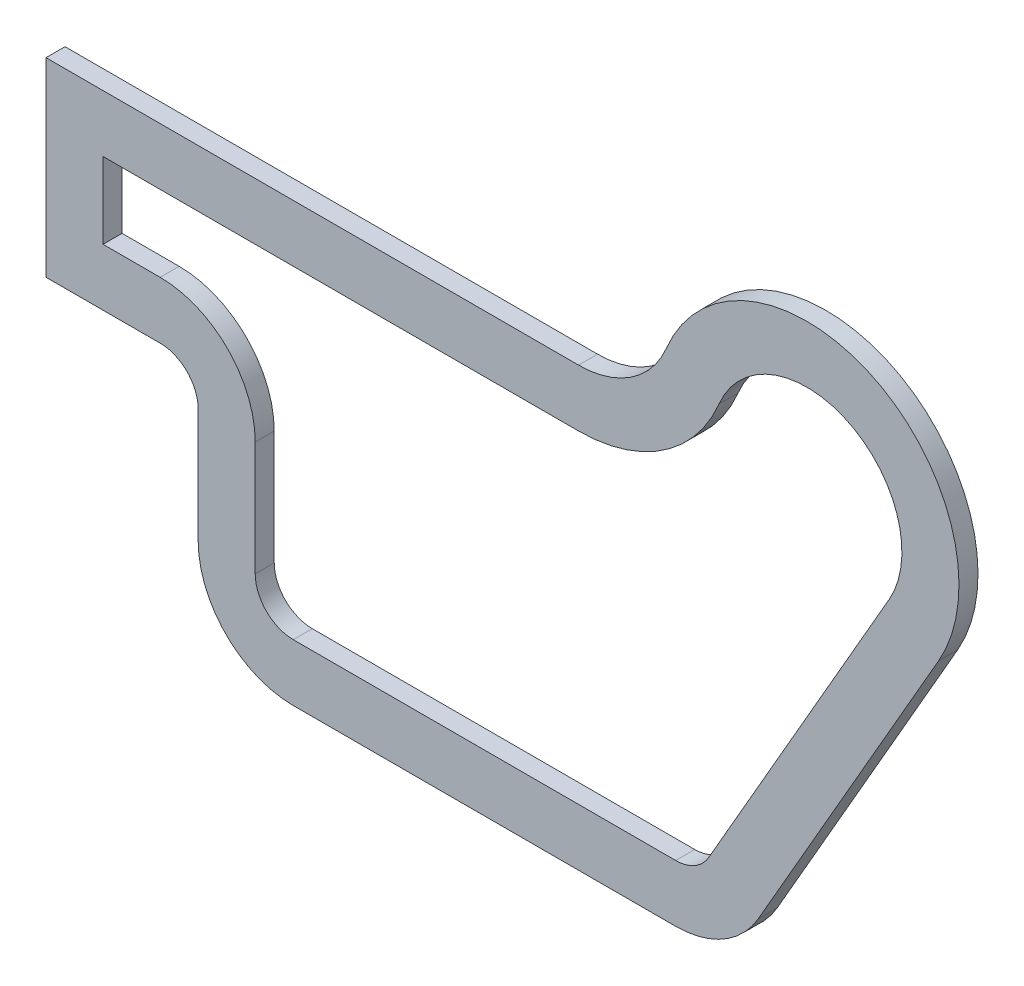
ISO-10303-21;
HEADER;
FILE_DESCRIPTION(('STEP AP214'),'2;1');
FILE_NAME('part.step','',(''),(''),'','','');
FILE_SCHEMA(('AUTOMOTIVE_DESIGN { 1 0 10303 214 1 1 1 1 }'));
ENDSEC;
DATA;
#1=APPLICATION_CONTEXT('core data for automotive mechanical design processes');
#2=APPLICATION_PROTOCOL_DEFINITION('international standard','automotive_design',2000,#1);
#3=PRODUCT_CONTEXT('',#1,'mechanical');
#4=PRODUCT('Part','Part','',(#3));
#5=PRODUCT_RELATED_PRODUCT_CATEGORY('part','',(#4));
#6=PRODUCT_DEFINITION_FORMATION('','',#4);
#7=PRODUCT_DEFINITION_CONTEXT('part definition',#1,'design');
#8=PRODUCT_DEFINITION('design','',#6,#7);
#9=PRODUCT_DEFINITION_SHAPE('','',#8);
#10=(LENGTH_UNIT() NAMED_UNIT(*) SI_UNIT(.MILLI.,.METRE.));
#11=(NAMED_UNIT(*) PLANE_ANGLE_UNIT() SI_UNIT($,.RADIAN.));
#12=(NAMED_UNIT(*) SI_UNIT($,.STERADIAN.) SOLID_ANGLE_UNIT());
#13=UNCERTAINTY_MEASURE_WITH_UNIT(LENGTH_MEASURE(1.E-05),#10,'distance_accuracy_value','');
#14=(GEOMETRIC_REPRESENTATION_CONTEXT(3) GLOBAL_UNCERTAINTY_ASSIGNED_CONTEXT((#13)) GLOBAL_UNIT_ASSIGNED_CONTEXT((#10,
#11,#12)) REPRESENTATION_CONTEXT('',''));
#15=CARTESIAN_POINT('',(0.,0.,0.));
#16=DIRECTION('',(0.,0.,1.));
#17=DIRECTION('',(1.,0.,0.));
#18=AXIS2_PLACEMENT_3D('',#15,#16,#17);
#19=CARTESIAN_POINT('',(65.,91.3359722282891,5.));
#20=DIRECTION('',(0.,0.,-1.));
#21=DIRECTION('',(-1.,0.,0.));
#22=AXIS2_PLACEMENT_3D('',#19,#20,#21);
#23=CYLINDRICAL_SURFACE('',#22,25.);
#24=CARTESIAN_POINT('',(65.,91.3359722282891,0.));
#25=DIRECTION('',(0.,0.,1.));
#26=DIRECTION('',(1.,0.,0.));
#27=AXIS2_PLACEMENT_3D('',#24,#25,#26);
#28=CIRCLE('',#27,25.);
#29=CARTESIAN_POINT('',(40.,91.3359722282893,0.));
#30=VERTEX_POINT('',#29);
#31=CARTESIAN_POINT('',(65.0000000000002,66.3359722282891,0.));
#32=VERTEX_POINT('',#31);
#33=EDGE_CURVE('E316',#30,#32,#28,.T.);
#34=ORIENTED_EDGE('',*,*,#33,.T.);
#35=DIRECTION('',(0.,0.,-1.));
#36=VECTOR('',#35,1.);
#37=CARTESIAN_POINT('',(65.0000000000002,66.3359722282891,5.));
#38=LINE('',#37,#36);
#39=CARTESIAN_POINT('',(65.0000000000002,66.3359722282891,5.));
#40=VERTEX_POINT('',#39);
#41=EDGE_CURVE('E11',#40,#32,#38,.T.);
#42=ORIENTED_EDGE('',*,*,#41,.F.);
#43=CARTESIAN_POINT('',(65.,91.3359722282891,5.));
#44=DIRECTION('',(0.,0.,1.));
#45=DIRECTION('',(1.,0.,0.));
#46=AXIS2_PLACEMENT_3D('',#43,#44,#45);
#47=CIRCLE('',#46,25.);
#48=CARTESIAN_POINT('',(40.,91.3359722282893,5.));
#49=VERTEX_POINT('',#48);
#50=EDGE_CURVE('E280',#49,#40,#47,.T.);
#51=ORIENTED_EDGE('',*,*,#50,.F.);
#52=DIRECTION('',(0.,0.,-1.));
#53=VECTOR('',#52,1.);
#54=CARTESIAN_POINT('',(40.,91.3359722282893,5.));
#55=LINE('',#54,#53);
#56=EDGE_CURVE('E315',#49,#30,#55,.T.);
#57=ORIENTED_EDGE('',*,*,#56,.T.);
#58=EDGE_LOOP('',(#34,#42,#51,#57));
#59=FACE_BOUND('',#58,.T.);
#60=ADVANCED_FACE('F39',(#59),#23,.T.);
#61=CARTESIAN_POINT('',(65.0000000000002,66.3359722282891,5.));
#62=DIRECTION('',(0.,1.,0.));
#63=DIRECTION('',(-1.,0.,0.));
#64=AXIS2_PLACEMENT_3D('',#61,#62,#63);
#65=PLANE('',#64);
#66=DIRECTION('',(1.,0.,0.));
#67=VECTOR('',#66,1.);
#68=CARTESIAN_POINT('',(65.0000000000002,66.3359722282891,0.));
#69=LINE('',#68,#67);
#70=CARTESIAN_POINT('',(165.538941774628,66.3359722282891,0.));
#71=VERTEX_POINT('',#70);
#72=EDGE_CURVE('E320',#32,#71,#69,.T.);
#73=ORIENTED_EDGE('',*,*,#72,.T.);
#74=DIRECTION('',(0.,0.,-1.));
#75=VECTOR('',#74,1.);
#76=CARTESIAN_POINT('',(165.538941774628,66.3359722282891,5.));
#77=LINE('',#76,#75);
#78=CARTESIAN_POINT('',(165.538941774628,66.3359722282891,5.));
#79=VERTEX_POINT('',#78);
#80=EDGE_CURVE('E47',#79,#71,#77,.T.);
#81=ORIENTED_EDGE('',*,*,#80,.F.);
#82=DIRECTION('',(1.,0.,0.));
#83=VECTOR('',#82,1.);
#84=CARTESIAN_POINT('',(65.0000000000002,66.3359722282891,5.));
#85=LINE('',#84,#83);
#86=EDGE_CURVE('E284',#40,#79,#85,.T.);
#87=ORIENTED_EDGE('',*,*,#86,.F.);
#88=ORIENTED_EDGE('',*,*,#41,.T.);
#89=EDGE_LOOP('',(#73,#81,#87,#88));
#90=FACE_BOUND('',#89,.T.);
#91=ADVANCED_FACE('F410',(#90),#65,.F.);
#92=CARTESIAN_POINT('',(165.538941774628,91.3359722282891,5.));
#93=DIRECTION('',(0.,0.,-1.));
#94=DIRECTION('',(-1.,0.,0.));
#95=AXIS2_PLACEMENT_3D('',#92,#93,#94);
#96=CYLINDRICAL_SURFACE('',#95,25.);
#97=CARTESIAN_POINT('',(165.538941774628,91.3359722282891,0.));
#98=DIRECTION('',(0.,0.,1.));
#99=DIRECTION('',(1.,0.,0.));
#100=AXIS2_PLACEMENT_3D('',#97,#98,#99);
#101=CIRCLE('',#100,25.);
#102=CARTESIAN_POINT('',(187.210014278647,78.8714378797642,0.));
#103=VERTEX_POINT('',#102);
#104=EDGE_CURVE('E323',#71,#103,#101,.T.);
#105=ORIENTED_EDGE('',*,*,#104,.T.);
#106=DIRECTION('',(0.,0.,-1.));
#107=VECTOR('',#106,1.);
#108=CARTESIAN_POINT('',(187.210014278647,78.8714378797642,5.));
#109=LINE('',#108,#107);
#110=CARTESIAN_POINT('',(187.210014278647,78.8714378797642,5.));
#111=VERTEX_POINT('',#110);
#112=EDGE_CURVE('E380',#111,#103,#109,.T.);
#113=ORIENTED_EDGE('',*,*,#112,.F.);
#114=CARTESIAN_POINT('',(165.538941774628,91.3359722282891,5.));
#115=DIRECTION('',(0.,0.,1.));
#116=DIRECTION('',(1.,0.,0.));
#117=AXIS2_PLACEMENT_3D('',#114,#115,#116);
#118=CIRCLE('',#117,25.);
#119=EDGE_CURVE('E288',#79,#111,#118,.T.);
#120=ORIENTED_EDGE('',*,*,#119,.F.);
#121=ORIENTED_EDGE('',*,*,#80,.T.);
#122=EDGE_LOOP('',(#105,#113,#120,#121));
#123=FACE_BOUND('',#122,.T.);
#124=ADVANCED_FACE('F389',(#123),#96,.T.);
#125=CARTESIAN_POINT('',(187.210014278647,78.8714378797642,5.));
#126=DIRECTION('',(-0.866842900160752,0.498581373941,0.));
#127=DIRECTION('',(-0.498581373941,-0.866842900160753,0.));
#128=AXIS2_PLACEMENT_3D('',#125,#126,#127);
#129=PLANE('',#128);
#130=DIRECTION('',(0.498581373941,0.866842900160752,0.));
#131=VECTOR('',#130,1.);
#132=CARTESIAN_POINT('',(187.210014278647,78.8714378797642,0.));
#133=LINE('',#132,#131);
#134=CARTESIAN_POINT('',(234.67371600643,161.392717270649,0.));
#135=VERTEX_POINT('',#134);
#136=EDGE_CURVE('E326',#103,#135,#133,.T.);
#137=ORIENTED_EDGE('',*,*,#136,.T.);
#138=DIRECTION('',(0.,0.,-1.));
#139=VECTOR('',#138,1.);
#140=CARTESIAN_POINT('',(234.67371600643,161.392717270649,5.));
#141=LINE('',#140,#139);
#142=CARTESIAN_POINT('',(234.67371600643,161.392717270649,5.));
#143=VERTEX_POINT('',#142);
#144=EDGE_CURVE('E376',#143,#135,#141,.T.);
#145=ORIENTED_EDGE('',*,*,#144,.F.);
#146=DIRECTION('',(0.498581373941,0.866842900160752,0.));
#147=VECTOR('',#146,1.);
#148=CARTESIAN_POINT('',(187.210014278647,78.8714378797642,5.));
#149=LINE('',#148,#147);
#150=EDGE_CURVE('E291',#111,#143,#149,.T.);
#151=ORIENTED_EDGE('',*,*,#150,.F.);
#152=ORIENTED_EDGE('',*,*,#112,.T.);
#153=EDGE_LOOP('',(#137,#145,#151,#152));
#154=FACE_BOUND('',#153,.T.);
#155=ADVANCED_FACE('F398',(#154),#129,.F.);
#156=CARTESIAN_POINT('',(200.,181.335972228289,5.));
#157=DIRECTION('',(0.,0.,-1.));
#158=DIRECTION('',(-1.,0.,0.));
#159=AXIS2_PLACEMENT_3D('',#156,#157,#158);
#160=CYLINDRICAL_SURFACE('',#159,40.);
#161=CARTESIAN_POINT('',(200.,181.335972228289,0.));
#162=DIRECTION('',(0.,0.,1.));
#163=DIRECTION('',(1.,0.,0.));
#164=AXIS2_PLACEMENT_3D('',#161,#162,#163);
#165=CIRCLE('',#164,40.);
#166=CARTESIAN_POINT('',(163.076923076923,196.720587612904,0.));
#167=VERTEX_POINT('',#166);
#168=EDGE_CURVE('E329',#135,#167,#165,.T.);
#169=ORIENTED_EDGE('',*,*,#168,.T.);
#170=DIRECTION('',(0.,0.,-1.));
#171=VECTOR('',#170,1.);
#172=CARTESIAN_POINT('',(163.076923076923,196.720587612904,5.));
#173=LINE('',#172,#171);
#174=CARTESIAN_POINT('',(163.076923076923,196.720587612904,5.));
#175=VERTEX_POINT('',#174);
#176=EDGE_CURVE('E372',#175,#167,#173,.T.);
#177=ORIENTED_EDGE('',*,*,#176,.F.);
#178=CARTESIAN_POINT('',(200.,181.335972228289,5.));
#179=DIRECTION('',(0.,0.,1.));
#180=DIRECTION('',(1.,0.,0.));
#181=AXIS2_PLACEMENT_3D('',#178,#179,#180);
#182=CIRCLE('',#181,40.);
#183=EDGE_CURVE('E294',#143,#175,#182,.T.);
#184=ORIENTED_EDGE('',*,*,#183,.F.);
#185=ORIENTED_EDGE('',*,*,#144,.T.);
#186=EDGE_LOOP('',(#169,#177,#184,#185));
#187=FACE_BOUND('',#186,.T.);
#188=ADVANCED_FACE('F402',(#187),#160,.T.);
#189=CARTESIAN_POINT('',(140.,206.335972228289,5.));
#190=DIRECTION('',(0.,0.,-1.));
#191=DIRECTION('',(-1.,0.,0.));
#192=AXIS2_PLACEMENT_3D('',#189,#190,#191);
#193=CYLINDRICAL_SURFACE('',#192,25.);
#194=CARTESIAN_POINT('',(140.,206.335972228289,0.));
#195=DIRECTION('',(0.,0.,-1.));
#196=DIRECTION('',(-1.,0.,0.));
#197=AXIS2_PLACEMENT_3D('',#194,#195,#196);
#198=CIRCLE('',#197,25.);
#199=CARTESIAN_POINT('',(140.,181.335972228289,0.));
#200=VERTEX_POINT('',#199);
#201=EDGE_CURVE('E332',#167,#200,#198,.T.);
#202=ORIENTED_EDGE('',*,*,#201,.T.);
#203=DIRECTION('',(0.,0.,-1.));
#204=VECTOR('',#203,1.);
#205=CARTESIAN_POINT('',(140.,181.335972228289,5.));
#206=LINE('',#205,#204);
#207=CARTESIAN_POINT('',(140.,181.335972228289,5.));
#208=VERTEX_POINT('',#207);
#209=EDGE_CURVE('E368',#208,#200,#206,.T.);
#210=ORIENTED_EDGE('',*,*,#209,.F.);
#211=CARTESIAN_POINT('',(140.,206.335972228289,5.));
#212=DIRECTION('',(0.,0.,-1.));
#213=DIRECTION('',(-1.,0.,0.));
#214=AXIS2_PLACEMENT_3D('',#211,#212,#213);
#215=CIRCLE('',#214,25.);
#216=EDGE_CURVE('E297',#175,#208,#215,.T.);
#217=ORIENTED_EDGE('',*,*,#216,.F.);
#218=ORIENTED_EDGE('',*,*,#176,.T.);
#219=EDGE_LOOP('',(#202,#210,#217,#218));
#220=FACE_BOUND('',#219,.T.);
#221=ADVANCED_FACE('F438',(#220),#193,.F.);
#222=CARTESIAN_POINT('',(140.,181.335972228289,5.));
#223=DIRECTION('',(0.,-1.,0.));
#224=DIRECTION('',(1.,0.,0.));
#225=AXIS2_PLACEMENT_3D('',#222,#223,#224);
#226=PLANE('',#225);
#227=DIRECTION('',(-1.,0.,0.));
#228=VECTOR('',#227,1.);
#229=CARTESIAN_POINT('',(140.,181.335972228289,0.));
#230=LINE('',#229,#228);
#231=CARTESIAN_POINT('',(0.,181.335972228289,0.));
#232=VERTEX_POINT('',#231);
#233=EDGE_CURVE('E335',#200,#232,#230,.T.);
#234=ORIENTED_EDGE('',*,*,#233,.T.);
#235=DIRECTION('',(0.,0.,-1.));
#236=VECTOR('',#235,1.);
#237=CARTESIAN_POINT('',(0.,181.335972228289,5.));
#238=LINE('',#237,#236);
#239=CARTESIAN_POINT('',(0.,181.335972228289,5.));
#240=VERTEX_POINT('',#239);
#241=EDGE_CURVE('E364',#240,#232,#238,.T.);
#242=ORIENTED_EDGE('',*,*,#241,.F.);
#243=DIRECTION('',(-1.,0.,0.));
#244=VECTOR('',#243,1.);
#245=CARTESIAN_POINT('',(140.,181.335972228289,5.));
#246=LINE('',#245,#244);
#247=EDGE_CURVE('E300',#208,#240,#246,.T.);
#248=ORIENTED_EDGE('',*,*,#247,.F.);
#249=ORIENTED_EDGE('',*,*,#209,.T.);
#250=EDGE_LOOP('',(#234,#242,#248,#249));
#251=FACE_BOUND('',#250,.T.);
#252=ADVANCED_FACE('F436',(#251),#226,.F.);
#253=CARTESIAN_POINT('',(0.,181.335972228289,5.));
#254=DIRECTION('',(1.,0.,0.));
#255=DIRECTION('',(0.,1.,0.));
#256=AXIS2_PLACEMENT_3D('',#253,#254,#255);
#257=PLANE('',#256);
#258=DIRECTION('',(0.,-1.,0.));
#259=VECTOR('',#258,1.);
#260=CARTESIAN_POINT('',(0.,181.335972228289,0.));
#261=LINE('',#260,#259);
#262=CARTESIAN_POINT('',(0.,131.335972228289,0.));
#263=VERTEX_POINT('',#262);
#264=EDGE_CURVE('E338',#232,#263,#261,.T.);
#265=ORIENTED_EDGE('',*,*,#264,.T.);
#266=DIRECTION('',(0.,0.,-1.));
#267=VECTOR('',#266,1.);
#268=CARTESIAN_POINT('',(0.,131.335972228289,5.));
#269=LINE('',#268,#267);
#270=CARTESIAN_POINT('',(0.,131.335972228289,5.));
#271=VERTEX_POINT('',#270);
#272=EDGE_CURVE('E360',#271,#263,#269,.T.);
#273=ORIENTED_EDGE('',*,*,#272,.F.);
#274=DIRECTION('',(0.,-1.,0.));
#275=VECTOR('',#274,1.);
#276=CARTESIAN_POINT('',(0.,181.335972228289,5.));
#277=LINE('',#276,#275);
#278=EDGE_CURVE('E303',#240,#271,#277,.T.);
#279=ORIENTED_EDGE('',*,*,#278,.F.);
#280=ORIENTED_EDGE('',*,*,#241,.T.);
#281=EDGE_LOOP('',(#265,#273,#279,#280));
#282=FACE_BOUND('',#281,.T.);
#283=ADVANCED_FACE('F431',(#282),#257,.F.);
#284=CARTESIAN_POINT('',(0.,131.335972228289,5.));
#285=DIRECTION('',(0.,1.,0.));
#286=DIRECTION('',(-1.,0.,0.));
#287=AXIS2_PLACEMENT_3D('',#284,#285,#286);
#288=PLANE('',#287);
#289=DIRECTION('',(1.,0.,0.));
#290=VECTOR('',#289,1.);
#291=CARTESIAN_POINT('',(0.,131.335972228289,0.));
#292=LINE('',#291,#290);
#293=CARTESIAN_POINT('',(29.9999999999999,131.335972228289,0.));
#294=VERTEX_POINT('',#293);
#295=EDGE_CURVE('E341',#263,#294,#292,.T.);
#296=ORIENTED_EDGE('',*,*,#295,.T.);
#297=DIRECTION('',(0.,0.,-1.));
#298=VECTOR('',#297,1.);
#299=CARTESIAN_POINT('',(29.9999999999999,131.335972228289,5.));
#300=LINE('',#299,#298);
#301=CARTESIAN_POINT('',(29.9999999999999,131.335972228289,5.));
#302=VERTEX_POINT('',#301);
#303=EDGE_CURVE('E356',#302,#294,#300,.T.);
#304=ORIENTED_EDGE('',*,*,#303,.F.);
#305=DIRECTION('',(1.,0.,0.));
#306=VECTOR('',#305,1.);
#307=CARTESIAN_POINT('',(0.,131.335972228289,5.));
#308=LINE('',#307,#306);
#309=EDGE_CURVE('E306',#271,#302,#308,.T.);
#310=ORIENTED_EDGE('',*,*,#309,.F.);
#311=ORIENTED_EDGE('',*,*,#272,.T.);
#312=EDGE_LOOP('',(#296,#304,#310,#311));
#313=FACE_BOUND('',#312,.T.);
#314=ADVANCED_FACE('F426',(#313),#288,.F.);
#315=CARTESIAN_POINT('',(30.,121.335972228289,5.));
#316=DIRECTION('',(0.,0.,-1.));
#317=DIRECTION('',(-1.,0.,0.));
#318=AXIS2_PLACEMENT_3D('',#315,#316,#317);
#319=CYLINDRICAL_SURFACE('',#318,9.99999999999999);
#320=CARTESIAN_POINT('',(30.,121.335972228289,0.));
#321=DIRECTION('',(0.,0.,-1.));
#322=DIRECTION('',(1.,0.,0.));
#323=AXIS2_PLACEMENT_3D('',#320,#321,#322);
#324=CIRCLE('',#323,9.99999999999999);
#325=CARTESIAN_POINT('',(40.,121.335972228289,0.));
#326=VERTEX_POINT('',#325);
#327=EDGE_CURVE('E344',#294,#326,#324,.T.);
#328=ORIENTED_EDGE('',*,*,#327,.T.);
#329=DIRECTION('',(0.,0.,-1.));
#330=VECTOR('',#329,1.);
#331=CARTESIAN_POINT('',(40.,121.335972228289,5.));
#332=LINE('',#331,#330);
#333=CARTESIAN_POINT('',(40.,121.335972228289,5.));
#334=VERTEX_POINT('',#333);
#335=EDGE_CURVE('E352',#334,#326,#332,.T.);
#336=ORIENTED_EDGE('',*,*,#335,.F.);
#337=CARTESIAN_POINT('',(30.,121.335972228289,5.));
#338=DIRECTION('',(0.,0.,-1.));
#339=DIRECTION('',(1.,0.,0.));
#340=AXIS2_PLACEMENT_3D('',#337,#338,#339);
#341=CIRCLE('',#340,9.99999999999999);
#342=EDGE_CURVE('E309',#302,#334,#341,.T.);
#343=ORIENTED_EDGE('',*,*,#342,.F.);
#344=ORIENTED_EDGE('',*,*,#303,.T.);
#345=EDGE_LOOP('',(#328,#336,#343,#344));
#346=FACE_BOUND('',#345,.T.);
#347=ADVANCED_FACE('F422',(#346),#319,.F.);
#348=CARTESIAN_POINT('',(40.,121.335972228289,5.));
#349=DIRECTION('',(1.,0.,0.));
#350=DIRECTION('',(0.,1.,0.));
#351=AXIS2_PLACEMENT_3D('',#348,#349,#350);
#352=PLANE('',#351);
#353=DIRECTION('',(0.,-1.,0.));
#354=VECTOR('',#353,1.);
#355=CARTESIAN_POINT('',(40.,121.335972228289,0.));
#356=LINE('',#355,#354);
#357=EDGE_CURVE('E285',#326,#30,#356,.T.);
#358=ORIENTED_EDGE('',*,*,#357,.T.);
#359=ORIENTED_EDGE('',*,*,#56,.F.);
#360=DIRECTION('',(0.,-1.,0.));
#361=VECTOR('',#360,1.);
#362=CARTESIAN_POINT('',(40.,121.335972228289,5.));
#363=LINE('',#362,#361);
#364=EDGE_CURVE('E312',#334,#49,#363,.T.);
#365=ORIENTED_EDGE('',*,*,#364,.F.);
#366=ORIENTED_EDGE('',*,*,#335,.T.);
#367=EDGE_LOOP('',(#358,#359,#365,#366));
#368=FACE_BOUND('',#367,.T.);
#369=ADVANCED_FACE('F417',(#368),#352,.F.);
#370=CARTESIAN_POINT('',(65.,91.3359722282891,5.));
#371=DIRECTION('',(0.,0.,1.));
#372=DIRECTION('',(1.,0.,0.));
#373=AXIS2_PLACEMENT_3D('',#370,#371,#372);
#374=PLANE('',#373);
#375=CARTESIAN_POINT('',(65.,91.3359722282891,5.));
#376=DIRECTION('',(0.,0.,1.));
#377=DIRECTION('',(1.,0.,0.));
#378=AXIS2_PLACEMENT_3D('',#375,#376,#377);
#379=CIRCLE('',#378,10.);
#380=CARTESIAN_POINT('',(55.,91.3359722282893,5.));
#381=VERTEX_POINT('',#380);
#382=CARTESIAN_POINT('',(65.0000000000002,81.3359722282891,5.));
#383=VERTEX_POINT('',#382);
#384=EDGE_CURVE('E216',#381,#383,#379,.T.);
#385=ORIENTED_EDGE('',*,*,#384,.F.);
#386=DIRECTION('',(0.,-1.,0.));
#387=VECTOR('',#386,1.);
#388=CARTESIAN_POINT('',(55.,121.335972228289,5.));
#389=LINE('',#388,#387);
#390=CARTESIAN_POINT('',(55.,121.335972228289,5.));
#391=VERTEX_POINT('',#390);
#392=EDGE_CURVE('E194',#391,#381,#389,.T.);
#393=ORIENTED_EDGE('',*,*,#392,.F.);
#394=CARTESIAN_POINT('',(30.,121.335972228289,5.));
#395=DIRECTION('',(0.,0.,1.));
#396=DIRECTION('',(1.,0.,0.));
#397=AXIS2_PLACEMENT_3D('',#394,#395,#396);
#398=CIRCLE('',#397,25.);
#399=CARTESIAN_POINT('',(29.9999999999999,146.335972228289,5.));
#400=VERTEX_POINT('',#399);
#401=EDGE_CURVE('E275',#400,#391,#398,.F.);
#402=ORIENTED_EDGE('',*,*,#401,.F.);
#403=DIRECTION('',(1.,0.,0.));
#404=VECTOR('',#403,1.);
#405=CARTESIAN_POINT('',(0.,146.335972228289,5.));
#406=LINE('',#405,#404);
#407=CARTESIAN_POINT('',(15.,146.335972228289,5.));
#408=VERTEX_POINT('',#407);
#409=EDGE_CURVE('E272',#408,#400,#406,.T.);
#410=ORIENTED_EDGE('',*,*,#409,.F.);
#411=DIRECTION('',(0.,-1.,0.));
#412=VECTOR('',#411,1.);
#413=CARTESIAN_POINT('',(15.,181.335972228289,5.));
#414=LINE('',#413,#412);
#415=CARTESIAN_POINT('',(15.,166.335972228289,5.));
#416=VERTEX_POINT('',#415);
#417=EDGE_CURVE('E269',#416,#408,#414,.T.);
#418=ORIENTED_EDGE('',*,*,#417,.F.);
#419=DIRECTION('',(-1.,0.,0.));
#420=VECTOR('',#419,1.);
#421=CARTESIAN_POINT('',(140.,166.335972228289,5.));
#422=LINE('',#421,#420);
#423=CARTESIAN_POINT('',(140.,166.335972228289,5.));
#424=VERTEX_POINT('',#423);
#425=EDGE_CURVE('E266',#424,#416,#422,.T.);
#426=ORIENTED_EDGE('',*,*,#425,.F.);
#427=CARTESIAN_POINT('',(140.,206.335972228289,5.));
#428=DIRECTION('',(0.,0.,1.));
#429=DIRECTION('',(1.,0.,0.));
#430=AXIS2_PLACEMENT_3D('',#427,#428,#429);
#431=CIRCLE('',#430,40.);
#432=CARTESIAN_POINT('',(176.923076923077,190.951356843674,5.));
#433=VERTEX_POINT('',#432);
#434=EDGE_CURVE('E263',#433,#424,#431,.F.);
#435=ORIENTED_EDGE('',*,*,#434,.F.);
#436=CARTESIAN_POINT('',(200.,181.335972228289,5.));
#437=DIRECTION('',(0.,0.,1.));
#438=DIRECTION('',(1.,0.,0.));
#439=AXIS2_PLACEMENT_3D('',#436,#437,#438);
#440=CIRCLE('',#439,25.);
#441=CARTESIAN_POINT('',(221.671072504019,168.871437879764,5.));
#442=VERTEX_POINT('',#441);
#443=EDGE_CURVE('E260',#442,#433,#440,.T.);
#444=ORIENTED_EDGE('',*,*,#443,.F.);
#445=DIRECTION('',(0.498581373941,0.866842900160753,0.));
#446=VECTOR('',#445,1.);
#447=CARTESIAN_POINT('',(174.207370776236,86.3501584888792,5.));
#448=LINE('',#447,#446);
#449=CARTESIAN_POINT('',(174.207370776236,86.3501584888792,5.));
#450=VERTEX_POINT('',#449);
#451=EDGE_CURVE('E257',#450,#442,#448,.T.);
#452=ORIENTED_EDGE('',*,*,#451,.F.);
#453=CARTESIAN_POINT('',(165.538941774628,91.3359722282891,5.));
#454=DIRECTION('',(0.,0.,1.));
#455=DIRECTION('',(1.,0.,0.));
#456=AXIS2_PLACEMENT_3D('',#453,#454,#455);
#457=CIRCLE('',#456,10.);
#458=CARTESIAN_POINT('',(165.538941774628,81.3359722282891,5.));
#459=VERTEX_POINT('',#458);
#460=EDGE_CURVE('E254',#459,#450,#457,.T.);
#461=ORIENTED_EDGE('',*,*,#460,.F.);
#462=DIRECTION('',(1.,0.,0.));
#463=VECTOR('',#462,1.);
#464=CARTESIAN_POINT('',(65.0000000000002,81.3359722282891,5.));
#465=LINE('',#464,#463);
#466=EDGE_CURVE('E220',#383,#459,#465,.T.);
#467=ORIENTED_EDGE('',*,*,#466,.F.);
#468=EDGE_LOOP('',(#385,#393,#402,#410,#418,#426,#435,#444,#452,#461,#467));
#469=FACE_BOUND('',#468,.T.);
#470=ORIENTED_EDGE('',*,*,#50,.T.);
#471=ORIENTED_EDGE('',*,*,#86,.T.);
#472=ORIENTED_EDGE('',*,*,#119,.T.);
#473=ORIENTED_EDGE('',*,*,#150,.T.);
#474=ORIENTED_EDGE('',*,*,#183,.T.);
#475=ORIENTED_EDGE('',*,*,#216,.T.);
#476=ORIENTED_EDGE('',*,*,#247,.T.);
#477=ORIENTED_EDGE('',*,*,#278,.T.);
#478=ORIENTED_EDGE('',*,*,#309,.T.);
#479=ORIENTED_EDGE('',*,*,#342,.T.);
#480=ORIENTED_EDGE('',*,*,#364,.T.);
#481=EDGE_LOOP('',(#470,#471,#472,#473,#474,#475,#476,#477,#478,#479,#480));
#482=FACE_BOUND('',#481,.T.);
#483=ADVANCED_FACE('F406',(#469,#482),#374,.T.);
#484=CARTESIAN_POINT('',(65.,91.3359722282891,0.));
#485=DIRECTION('',(0.,0.,1.));
#486=DIRECTION('',(1.,0.,0.));
#487=AXIS2_PLACEMENT_3D('',#484,#485,#486);
#488=PLANE('',#487);
#489=DIRECTION('',(0.,-1.,0.));
#490=VECTOR('',#489,1.);
#491=CARTESIAN_POINT('',(55.,121.335972228289,0.));
#492=LINE('',#491,#490);
#493=CARTESIAN_POINT('',(55.,121.335972228289,0.));
#494=VERTEX_POINT('',#493);
#495=CARTESIAN_POINT('',(55.,91.3359722282893,0.));
#496=VERTEX_POINT('',#495);
#497=EDGE_CURVE('E191',#494,#496,#492,.T.);
#498=ORIENTED_EDGE('',*,*,#497,.T.);
#499=CARTESIAN_POINT('',(65.,91.3359722282891,0.));
#500=DIRECTION('',(0.,0.,1.));
#501=DIRECTION('',(1.,0.,0.));
#502=AXIS2_PLACEMENT_3D('',#499,#500,#501);
#503=CIRCLE('',#502,10.);
#504=CARTESIAN_POINT('',(65.0000000000002,81.3359722282891,0.));
#505=VERTEX_POINT('',#504);
#506=EDGE_CURVE('E201',#496,#505,#503,.T.);
#507=ORIENTED_EDGE('',*,*,#506,.T.);
#508=DIRECTION('',(1.,0.,0.));
#509=VECTOR('',#508,1.);
#510=CARTESIAN_POINT('',(65.0000000000002,81.3359722282891,0.));
#511=LINE('',#510,#509);
#512=CARTESIAN_POINT('',(165.538941774628,81.3359722282891,0.));
#513=VERTEX_POINT('',#512);
#514=EDGE_CURVE('E208',#505,#513,#511,.T.);
#515=ORIENTED_EDGE('',*,*,#514,.T.);
#516=CARTESIAN_POINT('',(165.538941774628,91.3359722282891,0.));
#517=DIRECTION('',(0.,0.,1.));
#518=DIRECTION('',(1.,0.,0.));
#519=AXIS2_PLACEMENT_3D('',#516,#517,#518);
#520=CIRCLE('',#519,10.);
#521=CARTESIAN_POINT('',(174.207370776236,86.3501584888792,0.));
#522=VERTEX_POINT('',#521);
#523=EDGE_CURVE('E62',#513,#522,#520,.T.);
#524=ORIENTED_EDGE('',*,*,#523,.T.);
#525=DIRECTION('',(0.498581373941,0.866842900160753,0.));
#526=VECTOR('',#525,1.);
#527=CARTESIAN_POINT('',(174.207370776236,86.3501584888792,0.));
#528=LINE('',#527,#526);
#529=CARTESIAN_POINT('',(221.671072504019,168.871437879764,0.));
#530=VERTEX_POINT('',#529);
#531=EDGE_CURVE('E244',#522,#530,#528,.T.);
#532=ORIENTED_EDGE('',*,*,#531,.T.);
#533=CARTESIAN_POINT('',(200.,181.335972228289,0.));
#534=DIRECTION('',(0.,0.,1.));
#535=DIRECTION('',(1.,0.,0.));
#536=AXIS2_PLACEMENT_3D('',#533,#534,#535);
#537=CIRCLE('',#536,25.);
#538=CARTESIAN_POINT('',(176.923076923077,190.951356843674,0.));
#539=VERTEX_POINT('',#538);
#540=EDGE_CURVE('E240',#530,#539,#537,.T.);
#541=ORIENTED_EDGE('',*,*,#540,.T.);
#542=CARTESIAN_POINT('',(140.,206.335972228289,0.));
#543=DIRECTION('',(0.,0.,1.));
#544=DIRECTION('',(1.,0.,0.));
#545=AXIS2_PLACEMENT_3D('',#542,#543,#544);
#546=CIRCLE('',#545,40.);
#547=CARTESIAN_POINT('',(140.,166.335972228289,0.));
#548=VERTEX_POINT('',#547);
#549=EDGE_CURVE('E236',#539,#548,#546,.F.);
#550=ORIENTED_EDGE('',*,*,#549,.T.);
#551=DIRECTION('',(-1.,0.,0.));
#552=VECTOR('',#551,1.);
#553=CARTESIAN_POINT('',(140.,166.335972228289,0.));
#554=LINE('',#553,#552);
#555=CARTESIAN_POINT('',(15.,166.335972228289,0.));
#556=VERTEX_POINT('',#555);
#557=EDGE_CURVE('E232',#548,#556,#554,.T.);
#558=ORIENTED_EDGE('',*,*,#557,.T.);
#559=DIRECTION('',(0.,-1.,0.));
#560=VECTOR('',#559,1.);
#561=CARTESIAN_POINT('',(15.,181.335972228289,0.));
#562=LINE('',#561,#560);
#563=CARTESIAN_POINT('',(15.,146.335972228289,0.));
#564=VERTEX_POINT('',#563);
#565=EDGE_CURVE('E228',#556,#564,#562,.T.);
#566=ORIENTED_EDGE('',*,*,#565,.T.);
#567=DIRECTION('',(1.,0.,0.));
#568=VECTOR('',#567,1.);
#569=CARTESIAN_POINT('',(0.,146.335972228289,0.));
#570=LINE('',#569,#568);
#571=CARTESIAN_POINT('',(29.9999999999999,146.335972228289,0.));
#572=VERTEX_POINT('',#571);
#573=EDGE_CURVE('E222',#564,#572,#570,.T.);
#574=ORIENTED_EDGE('',*,*,#573,.T.);
#575=CARTESIAN_POINT('',(30.,121.335972228289,0.));
#576=DIRECTION('',(0.,0.,1.));
#577=DIRECTION('',(1.,0.,0.));
#578=AXIS2_PLACEMENT_3D('',#575,#576,#577);
#579=CIRCLE('',#578,25.);
#580=EDGE_CURVE('E214',#572,#494,#579,.F.);
#581=ORIENTED_EDGE('',*,*,#580,.T.);
#582=EDGE_LOOP('',(#498,#507,#515,#524,#532,#541,#550,#558,#566,#574,#581));
#583=FACE_BOUND('',#582,.T.);
#584=ORIENTED_EDGE('',*,*,#33,.F.);
#585=ORIENTED_EDGE('',*,*,#357,.F.);
#586=ORIENTED_EDGE('',*,*,#327,.F.);
#587=ORIENTED_EDGE('',*,*,#295,.F.);
#588=ORIENTED_EDGE('',*,*,#264,.F.);
#589=ORIENTED_EDGE('',*,*,#233,.F.);
#590=ORIENTED_EDGE('',*,*,#201,.F.);
#591=ORIENTED_EDGE('',*,*,#168,.F.);
#592=ORIENTED_EDGE('',*,*,#136,.F.);
#593=ORIENTED_EDGE('',*,*,#104,.F.);
#594=ORIENTED_EDGE('',*,*,#72,.F.);
#595=EDGE_LOOP('',(#584,#585,#586,#587,#588,#589,#590,#591,#592,#593,#594));
#596=FACE_BOUND('',#595,.T.);
#597=ADVANCED_FACE('F210',(#583,#596),#488,.F.);
#598=CARTESIAN_POINT('',(65.,91.3359722282891,5.));
#599=DIRECTION('',(0.,0.,-1.));
#600=DIRECTION('',(-1.,0.,0.));
#601=AXIS2_PLACEMENT_3D('',#598,#599,#600);
#602=CYLINDRICAL_SURFACE('',#601,10.);
#603=ORIENTED_EDGE('',*,*,#506,.F.);
#604=DIRECTION('',(0.,0.,-1.));
#605=VECTOR('',#604,1.);
#606=CARTESIAN_POINT('',(55.,91.3359722282892,5.));
#607=LINE('',#606,#605);
#608=EDGE_CURVE('E187',#381,#496,#607,.T.);
#609=ORIENTED_EDGE('',*,*,#608,.F.);
#610=ORIENTED_EDGE('',*,*,#384,.T.);
#611=DIRECTION('',(0.,0.,1.));
#612=VECTOR('',#611,1.);
#613=CARTESIAN_POINT('',(65.0000000000002,81.3359722282891,5.));
#614=LINE('',#613,#612);
#615=EDGE_CURVE('E204',#383,#505,#614,.F.);
#616=ORIENTED_EDGE('',*,*,#615,.T.);
#617=EDGE_LOOP('',(#603,#609,#610,#616));
#618=FACE_BOUND('',#617,.T.);
#619=ADVANCED_FACE('F202',(#618),#602,.F.);
#620=CARTESIAN_POINT('',(65.0000000000002,81.3359722282891,5.));
#621=DIRECTION('',(0.,1.,0.));
#622=DIRECTION('',(-1.,0.,0.));
#623=AXIS2_PLACEMENT_3D('',#620,#621,#622);
#624=PLANE('',#623);
#625=ORIENTED_EDGE('',*,*,#514,.F.);
#626=ORIENTED_EDGE('',*,*,#615,.F.);
#627=ORIENTED_EDGE('',*,*,#466,.T.);
#628=DIRECTION('',(0.,0.,-1.));
#629=VECTOR('',#628,1.);
#630=CARTESIAN_POINT('',(165.538941774628,81.3359722282891,5.));
#631=LINE('',#630,#629);
#632=EDGE_CURVE('E662',#459,#513,#631,.T.);
#633=ORIENTED_EDGE('',*,*,#632,.T.);
#634=EDGE_LOOP('',(#625,#626,#627,#633));
#635=FACE_BOUND('',#634,.T.);
#636=ADVANCED_FACE('F533',(#635),#624,.T.);
#637=CARTESIAN_POINT('',(165.538941774628,91.3359722282891,5.));
#638=DIRECTION('',(0.,0.,-1.));
#639=DIRECTION('',(-1.,0.,0.));
#640=AXIS2_PLACEMENT_3D('',#637,#638,#639);
#641=CYLINDRICAL_SURFACE('',#640,10.);
#642=ORIENTED_EDGE('',*,*,#523,.F.);
#643=ORIENTED_EDGE('',*,*,#632,.F.);
#644=ORIENTED_EDGE('',*,*,#460,.T.);
#645=DIRECTION('',(0.,0.,1.));
#646=VECTOR('',#645,1.);
#647=CARTESIAN_POINT('',(174.207370776236,86.3501584888792,5.));
#648=LINE('',#647,#646);
#649=EDGE_CURVE('E659',#450,#522,#648,.F.);
#650=ORIENTED_EDGE('',*,*,#649,.T.);
#651=EDGE_LOOP('',(#642,#643,#644,#650));
#652=FACE_BOUND('',#651,.T.);
#653=ADVANCED_FACE('F542',(#652),#641,.F.);
#654=CARTESIAN_POINT('',(174.207370776236,86.3501584888792,5.));
#655=DIRECTION('',(-0.866842900160752,0.498581373941,0.));
#656=DIRECTION('',(-0.498581373941,-0.866842900160753,0.));
#657=AXIS2_PLACEMENT_3D('',#654,#655,#656);
#658=PLANE('',#657);
#659=ORIENTED_EDGE('',*,*,#531,.F.);
#660=ORIENTED_EDGE('',*,*,#649,.F.);
#661=ORIENTED_EDGE('',*,*,#451,.T.);
#662=DIRECTION('',(0.,0.,-1.));
#663=VECTOR('',#662,1.);
#664=CARTESIAN_POINT('',(221.671072504019,168.871437879764,5.));
#665=LINE('',#664,#663);
#666=EDGE_CURVE('E656',#442,#530,#665,.T.);
#667=ORIENTED_EDGE('',*,*,#666,.T.);
#668=EDGE_LOOP('',(#659,#660,#661,#667));
#669=FACE_BOUND('',#668,.T.);
#670=ADVANCED_FACE('F552',(#669),#658,.T.);
#671=CARTESIAN_POINT('',(200.,181.335972228289,5.));
#672=DIRECTION('',(0.,0.,-1.));
#673=DIRECTION('',(-1.,0.,0.));
#674=AXIS2_PLACEMENT_3D('',#671,#672,#673);
#675=CYLINDRICAL_SURFACE('',#674,25.);
#676=ORIENTED_EDGE('',*,*,#540,.F.);
#677=ORIENTED_EDGE('',*,*,#666,.F.);
#678=ORIENTED_EDGE('',*,*,#443,.T.);
#679=DIRECTION('',(0.,0.,-1.));
#680=VECTOR('',#679,1.);
#681=CARTESIAN_POINT('',(176.923076923077,190.951356843674,5.));
#682=LINE('',#681,#680);
#683=EDGE_CURVE('E653',#433,#539,#682,.T.);
#684=ORIENTED_EDGE('',*,*,#683,.T.);
#685=EDGE_LOOP('',(#676,#677,#678,#684));
#686=FACE_BOUND('',#685,.T.);
#687=ADVANCED_FACE('F561',(#686),#675,.F.);
#688=CARTESIAN_POINT('',(140.,206.335972228289,5.));
#689=DIRECTION('',(0.,0.,-1.));
#690=DIRECTION('',(-1.,0.,0.));
#691=AXIS2_PLACEMENT_3D('',#688,#689,#690);
#692=CYLINDRICAL_SURFACE('',#691,40.);
#693=ORIENTED_EDGE('',*,*,#549,.F.);
#694=ORIENTED_EDGE('',*,*,#683,.F.);
#695=ORIENTED_EDGE('',*,*,#434,.T.);
#696=DIRECTION('',(0.,0.,1.));
#697=VECTOR('',#696,1.);
#698=CARTESIAN_POINT('',(140.,166.335972228289,5.));
#699=LINE('',#698,#697);
#700=EDGE_CURVE('E650',#424,#548,#699,.F.);
#701=ORIENTED_EDGE('',*,*,#700,.T.);
#702=EDGE_LOOP('',(#693,#694,#695,#701));
#703=FACE_BOUND('',#702,.T.);
#704=ADVANCED_FACE('F571',(#703),#692,.T.);
#705=CARTESIAN_POINT('',(140.,166.335972228289,5.));
#706=DIRECTION('',(0.,-1.,0.));
#707=DIRECTION('',(1.,0.,0.));
#708=AXIS2_PLACEMENT_3D('',#705,#706,#707);
#709=PLANE('',#708);
#710=ORIENTED_EDGE('',*,*,#557,.F.);
#711=ORIENTED_EDGE('',*,*,#700,.F.);
#712=ORIENTED_EDGE('',*,*,#425,.T.);
#713=DIRECTION('',(0.,0.,-1.));
#714=VECTOR('',#713,1.);
#715=CARTESIAN_POINT('',(15.,166.335972228289,5.));
#716=LINE('',#715,#714);
#717=EDGE_CURVE('E645',#416,#556,#716,.T.);
#718=ORIENTED_EDGE('',*,*,#717,.T.);
#719=EDGE_LOOP('',(#710,#711,#712,#718));
#720=FACE_BOUND('',#719,.T.);
#721=ADVANCED_FACE('F581',(#720),#709,.T.);
#722=CARTESIAN_POINT('',(15.,181.335972228289,5.));
#723=DIRECTION('',(1.,0.,0.));
#724=DIRECTION('',(0.,1.,0.));
#725=AXIS2_PLACEMENT_3D('',#722,#723,#724);
#726=PLANE('',#725);
#727=ORIENTED_EDGE('',*,*,#565,.F.);
#728=ORIENTED_EDGE('',*,*,#717,.F.);
#729=ORIENTED_EDGE('',*,*,#417,.T.);
#730=DIRECTION('',(0.,0.,-1.));
#731=VECTOR('',#730,1.);
#732=CARTESIAN_POINT('',(15.,146.335972228289,5.));
#733=LINE('',#732,#731);
#734=EDGE_CURVE('E639',#408,#564,#733,.T.);
#735=ORIENTED_EDGE('',*,*,#734,.T.);
#736=EDGE_LOOP('',(#727,#728,#729,#735));
#737=FACE_BOUND('',#736,.T.);
#738=ADVANCED_FACE('F591',(#737),#726,.T.);
#739=CARTESIAN_POINT('',(0.,146.335972228289,5.));
#740=DIRECTION('',(0.,1.,0.));
#741=DIRECTION('',(-1.,0.,0.));
#742=AXIS2_PLACEMENT_3D('',#739,#740,#741);
#743=PLANE('',#742);
#744=ORIENTED_EDGE('',*,*,#573,.F.);
#745=ORIENTED_EDGE('',*,*,#734,.F.);
#746=ORIENTED_EDGE('',*,*,#409,.T.);
#747=DIRECTION('',(0.,0.,-1.));
#748=VECTOR('',#747,1.);
#749=CARTESIAN_POINT('',(29.9999999999998,146.335972228289,5.));
#750=LINE('',#749,#748);
#751=EDGE_CURVE('E634',#400,#572,#750,.T.);
#752=ORIENTED_EDGE('',*,*,#751,.T.);
#753=EDGE_LOOP('',(#744,#745,#746,#752));
#754=FACE_BOUND('',#753,.T.);
#755=ADVANCED_FACE('F601',(#754),#743,.T.);
#756=CARTESIAN_POINT('',(30.,121.335972228289,5.));
#757=DIRECTION('',(0.,0.,-1.));
#758=DIRECTION('',(-1.,0.,0.));
#759=AXIS2_PLACEMENT_3D('',#756,#757,#758);
#760=CYLINDRICAL_SURFACE('',#759,25.);
#761=ORIENTED_EDGE('',*,*,#580,.F.);
#762=ORIENTED_EDGE('',*,*,#751,.F.);
#763=ORIENTED_EDGE('',*,*,#401,.T.);
#764=DIRECTION('',(0.,0.,1.));
#765=VECTOR('',#764,1.);
#766=CARTESIAN_POINT('',(55.,121.335972228289,5.));
#767=LINE('',#766,#765);
#768=EDGE_CURVE('E54',#391,#494,#767,.F.);
#769=ORIENTED_EDGE('',*,*,#768,.T.);
#770=EDGE_LOOP('',(#761,#762,#763,#769));
#771=FACE_BOUND('',#770,.T.);
#772=ADVANCED_FACE('F611',(#771),#760,.T.);
#773=CARTESIAN_POINT('',(55.,121.335972228289,5.));
#774=DIRECTION('',(1.,0.,0.));
#775=DIRECTION('',(0.,1.,0.));
#776=AXIS2_PLACEMENT_3D('',#773,#774,#775);
#777=PLANE('',#776);
#778=ORIENTED_EDGE('',*,*,#497,.F.);
#779=ORIENTED_EDGE('',*,*,#768,.F.);
#780=ORIENTED_EDGE('',*,*,#392,.T.);
#781=ORIENTED_EDGE('',*,*,#608,.T.);
#782=EDGE_LOOP('',(#778,#779,#780,#781));
#783=FACE_BOUND('',#782,.T.);
#784=ADVANCED_FACE('F189',(#783),#777,.T.);
#785=CLOSED_SHELL('',(#60,#91,#124,#155,#188,#221,#252,#283,#314,#347,#369,#483,#597,#619,#636,
#653,#670,#687,#704,#721,#738,#755,#772,#784));
#786=MANIFOLD_SOLID_BREP('B2',#785);
#787=ADVANCED_BREP_SHAPE_REPRESENTATION('',(#18,#786),#14);
#788=SHAPE_DEFINITION_REPRESENTATION(#9,#787);
ENDSEC;
END-ISO-10303-21;
